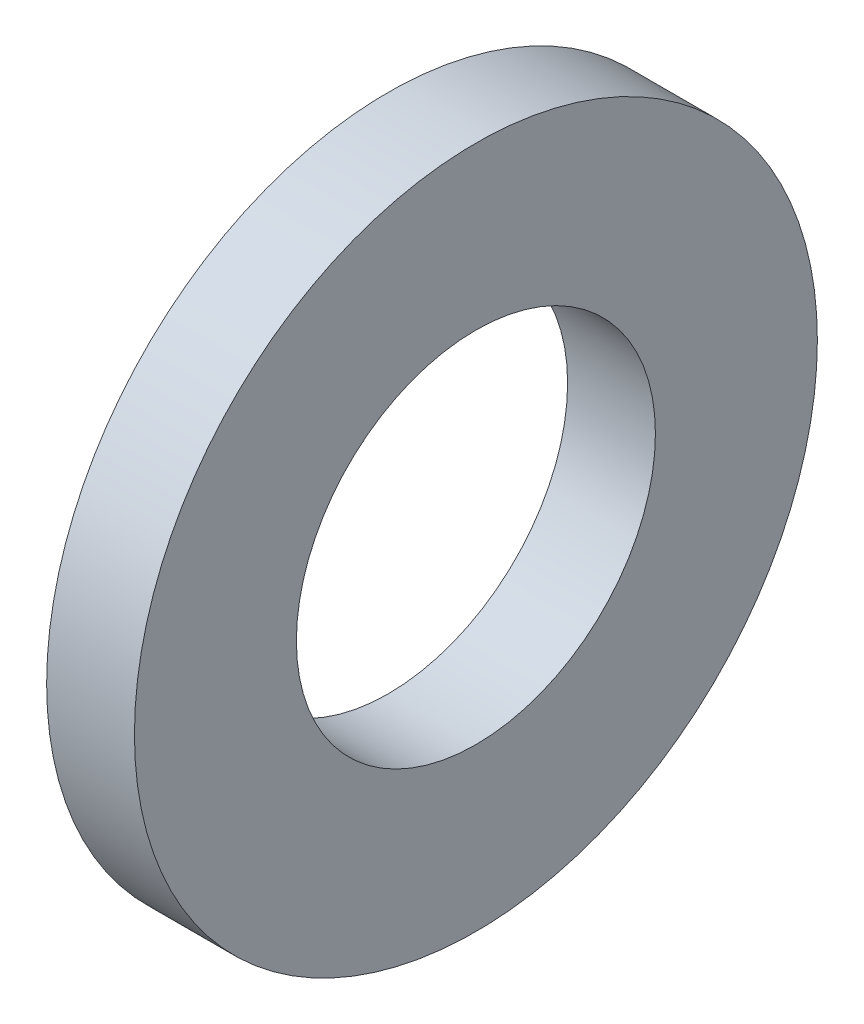
ISO-10303-21;
HEADER;
FILE_DESCRIPTION(('STEP AP214'),'2;1');
FILE_NAME('part.step','',(''),(''),'','','');
FILE_SCHEMA(('AUTOMOTIVE_DESIGN { 1 0 10303 214 1 1 1 1 }'));
ENDSEC;
DATA;
#1=APPLICATION_CONTEXT('core data for automotive mechanical design processes');
#2=APPLICATION_PROTOCOL_DEFINITION('international standard','automotive_design',2000,#1);
#3=PRODUCT_CONTEXT('',#1,'mechanical');
#4=PRODUCT('Part','Part','',(#3));
#5=PRODUCT_RELATED_PRODUCT_CATEGORY('part','',(#4));
#6=PRODUCT_DEFINITION_FORMATION('','',#4);
#7=PRODUCT_DEFINITION_CONTEXT('part definition',#1,'design');
#8=PRODUCT_DEFINITION('design','',#6,#7);
#9=PRODUCT_DEFINITION_SHAPE('','',#8);
#10=(LENGTH_UNIT() NAMED_UNIT(*) SI_UNIT(.MILLI.,.METRE.));
#11=(NAMED_UNIT(*) PLANE_ANGLE_UNIT() SI_UNIT($,.RADIAN.));
#12=(NAMED_UNIT(*) SI_UNIT($,.STERADIAN.) SOLID_ANGLE_UNIT());
#13=UNCERTAINTY_MEASURE_WITH_UNIT(LENGTH_MEASURE(1.E-05),#10,'distance_accuracy_value','');
#14=(GEOMETRIC_REPRESENTATION_CONTEXT(3) GLOBAL_UNCERTAINTY_ASSIGNED_CONTEXT((#13)) GLOBAL_UNIT_ASSIGNED_CONTEXT((#10,
#11,#12)) REPRESENTATION_CONTEXT('',''));
#15=CARTESIAN_POINT('',(0.,0.,0.));
#16=DIRECTION('',(0.,0.,1.));
#17=DIRECTION('',(1.,0.,0.));
#18=AXIS2_PLACEMENT_3D('',#15,#16,#17);
#19=CARTESIAN_POINT('',(-34.925,0.,0.));
#20=DIRECTION('',(-1.,0.,0.));
#21=DIRECTION('',(0.,0.,1.));
#22=AXIS2_PLACEMENT_3D('',#19,#20,#21);
#23=CYLINDRICAL_SURFACE('',#22,1.84);
#24=CARTESIAN_POINT('',(0.,0.,0.));
#25=DIRECTION('',(-1.,0.,0.));
#26=DIRECTION('',(0.,0.,1.));
#27=AXIS2_PLACEMENT_3D('',#24,#25,#26);
#28=CIRCLE('',#27,1.84);
#29=CARTESIAN_POINT('',(0.,0.,1.84));
#30=VERTEX_POINT('',#29);
#31=EDGE_CURVE('E10',#30,#30,#28,.T.);
#32=ORIENTED_EDGE('',*,*,#31,.F.);
#33=EDGE_LOOP('',(#32));
#34=FACE_BOUND('',#33,.T.);
#35=CARTESIAN_POINT('',(-0.9,0.,0.));
#36=DIRECTION('',(-1.,0.,0.));
#37=DIRECTION('',(0.,0.,1.));
#38=AXIS2_PLACEMENT_3D('',#35,#36,#37);
#39=CIRCLE('',#38,1.84);
#40=CARTESIAN_POINT('',(-0.9,0.,1.84));
#41=VERTEX_POINT('',#40);
#42=EDGE_CURVE('E29',#41,#41,#39,.T.);
#43=ORIENTED_EDGE('',*,*,#42,.T.);
#44=EDGE_LOOP('',(#43));
#45=FACE_BOUND('',#44,.T.);
#46=ADVANCED_FACE('F15',(#34,#45),#23,.F.);
#47=CARTESIAN_POINT('',(0.,1.84,0.));
#48=DIRECTION('',(-1.,0.,0.));
#49=DIRECTION('',(0.,0.,1.));
#50=AXIS2_PLACEMENT_3D('',#47,#48,#49);
#51=PLANE('',#50);
#52=CARTESIAN_POINT('',(0.,0.,0.));
#53=DIRECTION('',(-1.,0.,0.));
#54=DIRECTION('',(0.,0.,1.));
#55=AXIS2_PLACEMENT_3D('',#52,#53,#54);
#56=CIRCLE('',#55,3.5);
#57=CARTESIAN_POINT('',(0.,0.,3.5));
#58=VERTEX_POINT('',#57);
#59=EDGE_CURVE('E21',#58,#58,#56,.T.);
#60=ORIENTED_EDGE('',*,*,#59,.F.);
#61=EDGE_LOOP('',(#60));
#62=FACE_BOUND('',#61,.T.);
#63=ORIENTED_EDGE('',*,*,#31,.T.);
#64=EDGE_LOOP('',(#63));
#65=FACE_BOUND('',#64,.T.);
#66=ADVANCED_FACE('F44',(#62,#65),#51,.F.);
#67=CARTESIAN_POINT('',(-34.925,0.,0.));
#68=DIRECTION('',(-1.,0.,0.));
#69=DIRECTION('',(0.,0.,1.));
#70=AXIS2_PLACEMENT_3D('',#67,#68,#69);
#71=CYLINDRICAL_SURFACE('',#70,3.5);
#72=CARTESIAN_POINT('',(-0.9,0.,0.));
#73=DIRECTION('',(-1.,0.,0.));
#74=DIRECTION('',(0.,0.,1.));
#75=AXIS2_PLACEMENT_3D('',#72,#73,#74);
#76=CIRCLE('',#75,3.5);
#77=CARTESIAN_POINT('',(-0.9,0.,3.5));
#78=VERTEX_POINT('',#77);
#79=EDGE_CURVE('E25',#78,#78,#76,.T.);
#80=ORIENTED_EDGE('',*,*,#79,.F.);
#81=EDGE_LOOP('',(#80));
#82=FACE_BOUND('',#81,.T.);
#83=ORIENTED_EDGE('',*,*,#59,.T.);
#84=EDGE_LOOP('',(#83));
#85=FACE_BOUND('',#84,.T.);
#86=ADVANCED_FACE('F39',(#82,#85),#71,.T.);
#87=CARTESIAN_POINT('',(-0.9,3.5,0.));
#88=DIRECTION('',(1.,0.,0.));
#89=DIRECTION('',(0.,0.,-1.));
#90=AXIS2_PLACEMENT_3D('',#87,#88,#89);
#91=PLANE('',#90);
#92=ORIENTED_EDGE('',*,*,#42,.F.);
#93=EDGE_LOOP('',(#92));
#94=FACE_BOUND('',#93,.T.);
#95=ORIENTED_EDGE('',*,*,#79,.T.);
#96=EDGE_LOOP('',(#95));
#97=FACE_BOUND('',#96,.T.);
#98=ADVANCED_FACE('F36',(#94,#97),#91,.F.);
#99=CLOSED_SHELL('',(#46,#66,#86,#98));
#100=MANIFOLD_SOLID_BREP('B1',#99);
#101=ADVANCED_BREP_SHAPE_REPRESENTATION('',(#18,#100),#14);
#102=SHAPE_DEFINITION_REPRESENTATION(#9,#101);
ENDSEC;
END-ISO-10303-21;
